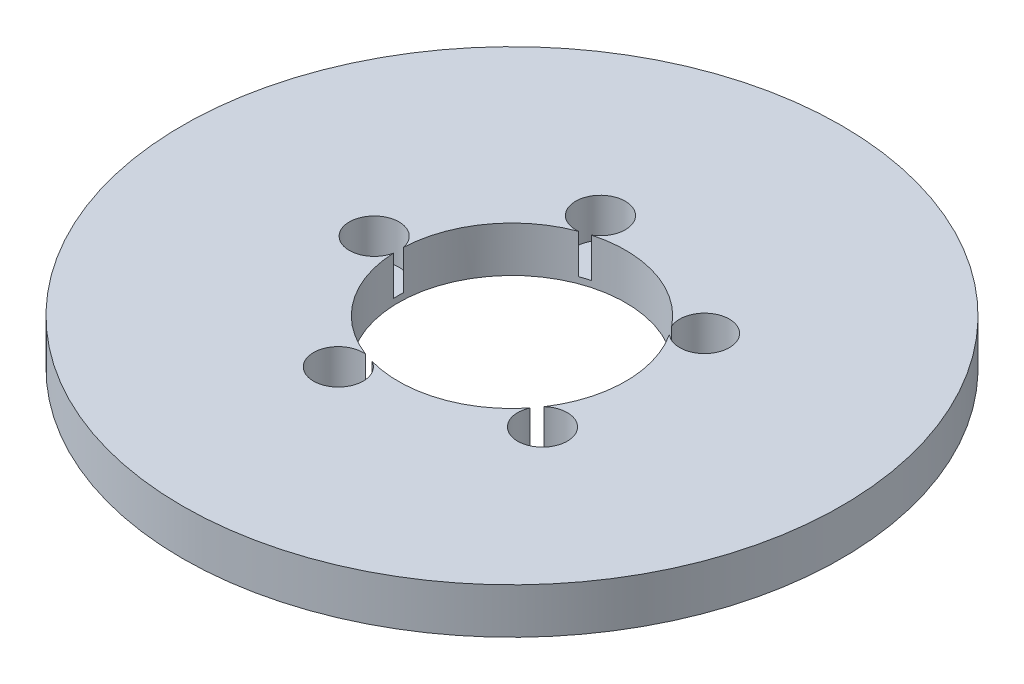
ISO-10303-21;
HEADER;
FILE_DESCRIPTION(('STEP AP214'),'2;1');
FILE_NAME('part.step','',(''),(''),'','','');
FILE_SCHEMA(('AUTOMOTIVE_DESIGN { 1 0 10303 214 1 1 1 1 }'));
ENDSEC;
DATA;
#1=APPLICATION_CONTEXT('core data for automotive mechanical design processes');
#2=APPLICATION_PROTOCOL_DEFINITION('international standard','automotive_design',2000,#1);
#3=PRODUCT_CONTEXT('',#1,'mechanical');
#4=PRODUCT('Part','Part','',(#3));
#5=PRODUCT_RELATED_PRODUCT_CATEGORY('part','',(#4));
#6=PRODUCT_DEFINITION_FORMATION('','',#4);
#7=PRODUCT_DEFINITION_CONTEXT('part definition',#1,'design');
#8=PRODUCT_DEFINITION('design','',#6,#7);
#9=PRODUCT_DEFINITION_SHAPE('','',#8);
#10=(LENGTH_UNIT() NAMED_UNIT(*) SI_UNIT(.MILLI.,.METRE.));
#11=(NAMED_UNIT(*) PLANE_ANGLE_UNIT() SI_UNIT($,.RADIAN.));
#12=(NAMED_UNIT(*) SI_UNIT($,.STERADIAN.) SOLID_ANGLE_UNIT());
#13=UNCERTAINTY_MEASURE_WITH_UNIT(LENGTH_MEASURE(1.E-05),#10,'distance_accuracy_value','');
#14=(GEOMETRIC_REPRESENTATION_CONTEXT(3) GLOBAL_UNCERTAINTY_ASSIGNED_CONTEXT((#13)) GLOBAL_UNIT_ASSIGNED_CONTEXT((#10,
#11,#12)) REPRESENTATION_CONTEXT('',''));
#15=CARTESIAN_POINT('',(0.,0.,0.));
#16=DIRECTION('',(0.,0.,1.));
#17=DIRECTION('',(1.,0.,0.));
#18=AXIS2_PLACEMENT_3D('',#15,#16,#17);
#19=CARTESIAN_POINT('',(0.,10.,0.));
#20=DIRECTION('',(0.,-1.,0.));
#21=DIRECTION('',(0.,0.,-1.));
#22=AXIS2_PLACEMENT_3D('',#19,#20,#21);
#23=CYLINDRICAL_SURFACE('',#22,72.5);
#24=CARTESIAN_POINT('',(0.,10.,0.));
#25=DIRECTION('',(0.,1.,0.));
#26=DIRECTION('',(0.,0.,1.));
#27=AXIS2_PLACEMENT_3D('',#24,#25,#26);
#28=CIRCLE('',#27,72.5);
#29=CARTESIAN_POINT('',(0.,10.,72.5));
#30=VERTEX_POINT('',#29);
#31=EDGE_CURVE('E160',#30,#30,#28,.T.);
#32=ORIENTED_EDGE('',*,*,#31,.F.);
#33=EDGE_LOOP('',(#32));
#34=FACE_BOUND('',#33,.T.);
#35=CARTESIAN_POINT('',(0.,0.,0.));
#36=DIRECTION('',(0.,1.,0.));
#37=DIRECTION('',(0.,0.,1.));
#38=AXIS2_PLACEMENT_3D('',#35,#36,#37);
#39=CIRCLE('',#38,72.5);
#40=CARTESIAN_POINT('',(0.,0.,72.5));
#41=VERTEX_POINT('',#40);
#42=EDGE_CURVE('E153',#41,#41,#39,.T.);
#43=ORIENTED_EDGE('',*,*,#42,.T.);
#44=EDGE_LOOP('',(#43));
#45=FACE_BOUND('',#44,.T.);
#46=ADVANCED_FACE('F39',(#34,#45),#23,.T.);
#47=CARTESIAN_POINT('',(0.,10.,0.));
#48=DIRECTION('',(0.,1.,0.));
#49=DIRECTION('',(0.,0.,1.));
#50=AXIS2_PLACEMENT_3D('',#47,#48,#49);
#51=PLANE('',#50);
#52=CARTESIAN_POINT('',(-9.36912817671135,10.,28.8352115471496));
#53=DIRECTION('',(0.,1.,0.));
#54=DIRECTION('',(0.951056516295155,0.,0.309016994374945));
#55=AXIS2_PLACEMENT_3D('',#52,#53,#54);
#56=CIRCLE('',#55,5.45902859178882);
#57=CARTESIAN_POINT('',(-8.77792244755192,10.,23.4082907856333));
#58=VERTEX_POINT('',#57);
#59=CARTESIAN_POINT('',(-6.65755966979406,10.,24.0972384152859));
#60=VERTEX_POINT('',#59);
#61=EDGE_CURVE('E186',#58,#60,#56,.T.);
#62=ORIENTED_EDGE('',*,*,#61,.F.);
#63=CARTESIAN_POINT('',(0.,10.,0.));
#64=DIRECTION('',(0.,1.,0.));
#65=DIRECTION('',(0.,0.,1.));
#66=AXIS2_PLACEMENT_3D('',#63,#64,#65);
#67=CIRCLE('',#66,25.);
#68=CARTESIAN_POINT('',(-24.9751346986072,10.,1.11474068124668));
#69=VERTEX_POINT('',#68);
#70=EDGE_CURVE('E148',#69,#58,#67,.T.);
#71=ORIENTED_EDGE('',*,*,#70,.F.);
#72=CARTESIAN_POINT('',(-30.3191356697469,10.,0.));
#73=DIRECTION('',(0.,1.,0.));
#74=DIRECTION('',(0.,0.,1.));
#75=AXIS2_PLACEMENT_3D('',#72,#73,#74);
#76=CIRCLE('',#75,5.45902859178882);
#77=CARTESIAN_POINT('',(-24.9751346986072,10.,-1.11474068124668));
#78=VERTEX_POINT('',#77);
#79=EDGE_CURVE('E142',#78,#69,#76,.T.);
#80=ORIENTED_EDGE('',*,*,#79,.F.);
#81=CARTESIAN_POINT('',(-8.77792244755228,10.,-23.4082907856332));
#82=VERTEX_POINT('',#81);
#83=EDGE_CURVE('E132',#82,#78,#67,.T.);
#84=ORIENTED_EDGE('',*,*,#83,.F.);
#85=CARTESIAN_POINT('',(-9.36912817671176,10.,-28.8352115471495));
#86=DIRECTION('',(0.,1.,0.));
#87=DIRECTION('',(-0.95105651629515,0.,0.309016994374958));
#88=AXIS2_PLACEMENT_3D('',#85,#86,#87);
#89=CIRCLE('',#88,5.45902859178882);
#90=CARTESIAN_POINT('',(-6.65755966979437,10.,-24.0972384152858));
#91=VERTEX_POINT('',#90);
#92=EDGE_CURVE('E111',#91,#82,#89,.T.);
#93=ORIENTED_EDGE('',*,*,#92,.F.);
#94=CARTESIAN_POINT('',(19.5500802754093,10.,-15.5818600053092));
#95=VERTEX_POINT('',#94);
#96=EDGE_CURVE('E141',#95,#91,#67,.T.);
#97=ORIENTED_EDGE('',*,*,#96,.F.);
#98=CARTESIAN_POINT('',(24.5286960115847,10.,-17.8211408089321));
#99=DIRECTION('',(0.,1.,0.));
#100=DIRECTION('',(-0.58778525229248,0.,-0.809016994374942));
#101=AXIS2_PLACEMENT_3D('',#98,#99,#100);
#102=CIRCLE('',#101,5.45902859178882);
#103=CARTESIAN_POINT('',(20.8605365405438,10.,-13.7781716944098));
#104=VERTEX_POINT('',#103);
#105=EDGE_CURVE('E173',#104,#95,#102,.T.);
#106=ORIENTED_EDGE('',*,*,#105,.F.);
#107=CARTESIAN_POINT('',(20.860536540544,10.,13.7781716944095));
#108=VERTEX_POINT('',#107);
#109=EDGE_CURVE('E150',#108,#104,#67,.T.);
#110=ORIENTED_EDGE('',*,*,#109,.F.);
#111=CARTESIAN_POINT('',(24.528696011585,10.,17.8211408089317));
#112=DIRECTION('',(0.,1.,0.));
#113=DIRECTION('',(0.587785252292469,0.,-0.809016994374951));
#114=AXIS2_PLACEMENT_3D('',#111,#112,#113);
#115=CIRCLE('',#114,5.45902859178882);
#116=CARTESIAN_POINT('',(19.5500802754095,10.,15.5818600053089));
#117=VERTEX_POINT('',#116);
#118=EDGE_CURVE('E172',#117,#108,#115,.T.);
#119=ORIENTED_EDGE('',*,*,#118,.F.);
#120=EDGE_CURVE('E152',#60,#117,#67,.T.);
#121=ORIENTED_EDGE('',*,*,#120,.F.);
#122=EDGE_LOOP('',(#62,#71,#80,#84,#93,#97,#106,#110,#119,#121));
#123=FACE_BOUND('',#122,.T.);
#124=ORIENTED_EDGE('',*,*,#31,.T.);
#125=EDGE_LOOP('',(#124));
#126=FACE_BOUND('',#125,.T.);
#127=ADVANCED_FACE('F138',(#123,#126),#51,.T.);
#128=CARTESIAN_POINT('',(0.,0.,0.));
#129=DIRECTION('',(0.,1.,0.));
#130=DIRECTION('',(0.,0.,1.));
#131=AXIS2_PLACEMENT_3D('',#128,#129,#130);
#132=PLANE('',#131);
#133=CARTESIAN_POINT('',(0.,0.,0.));
#134=DIRECTION('',(0.,1.,0.));
#135=DIRECTION('',(0.,0.,1.));
#136=AXIS2_PLACEMENT_3D('',#133,#134,#135);
#137=CIRCLE('',#136,25.);
#138=CARTESIAN_POINT('',(0.,0.,25.));
#139=VERTEX_POINT('',#138);
#140=EDGE_CURVE('E145',#139,#139,#137,.T.);
#141=ORIENTED_EDGE('',*,*,#140,.T.);
#142=EDGE_LOOP('',(#141));
#143=FACE_BOUND('',#142,.T.);
#144=ORIENTED_EDGE('',*,*,#42,.F.);
#145=EDGE_LOOP('',(#144));
#146=FACE_BOUND('',#145,.T.);
#147=ADVANCED_FACE('F216',(#143,#146),#132,.F.);
#148=CARTESIAN_POINT('',(0.,10.,0.));
#149=DIRECTION('',(0.,-1.,0.));
#150=DIRECTION('',(0.,0.,-1.));
#151=AXIS2_PLACEMENT_3D('',#148,#149,#150);
#152=CYLINDRICAL_SURFACE('',#151,25.);
#153=DIRECTION('',(0.,1.,0.));
#154=VECTOR('',#153,1.);
#155=CARTESIAN_POINT('',(-8.77792244755195,5.67729908317657,23.4082907856333));
#156=LINE('',#155,#154);
#157=CARTESIAN_POINT('',(-8.77792244755192,1.35459816635315,23.4082907856333));
#158=VERTEX_POINT('',#157);
#159=EDGE_CURVE('E11',#158,#58,#156,.T.);
#160=ORIENTED_EDGE('',*,*,#159,.F.);
#161=CARTESIAN_POINT('',(0.,1.35459816635315,0.));
#162=DIRECTION('',(0.,1.,0.));
#163=DIRECTION('',(0.,0.,1.));
#164=AXIS2_PLACEMENT_3D('',#161,#162,#163);
#165=CIRCLE('',#164,25.);
#166=CARTESIAN_POINT('',(-6.65755966979406,1.35459816635315,24.0972384152859));
#167=VERTEX_POINT('',#166);
#168=EDGE_CURVE('E192',#158,#167,#165,.T.);
#169=ORIENTED_EDGE('',*,*,#168,.T.);
#170=DIRECTION('',(0.,1.,0.));
#171=VECTOR('',#170,1.);
#172=CARTESIAN_POINT('',(-6.65755966979403,5.67729908317657,24.0972384152859));
#173=LINE('',#172,#171);
#174=EDGE_CURVE('E46',#60,#167,#173,.F.);
#175=ORIENTED_EDGE('',*,*,#174,.F.);
#176=ORIENTED_EDGE('',*,*,#120,.T.);
#177=DIRECTION('',(0.,1.,0.));
#178=VECTOR('',#177,1.);
#179=CARTESIAN_POINT('',(19.5500802754095,5.67729908317657,15.5818600053089));
#180=LINE('',#179,#178);
#181=CARTESIAN_POINT('',(19.5500802754095,1.35459816635315,15.5818600053089));
#182=VERTEX_POINT('',#181);
#183=EDGE_CURVE('E195',#182,#117,#180,.T.);
#184=ORIENTED_EDGE('',*,*,#183,.F.);
#185=CARTESIAN_POINT('',(0.,1.35459816635315,0.));
#186=DIRECTION('',(0.,1.,0.));
#187=DIRECTION('',(0.,0.,1.));
#188=AXIS2_PLACEMENT_3D('',#185,#186,#187);
#189=CIRCLE('',#188,25.);
#190=CARTESIAN_POINT('',(20.860536540544,1.35459816635315,13.7781716944095));
#191=VERTEX_POINT('',#190);
#192=EDGE_CURVE('E197',#182,#191,#189,.T.);
#193=ORIENTED_EDGE('',*,*,#192,.T.);
#194=DIRECTION('',(0.,1.,0.));
#195=VECTOR('',#194,1.);
#196=CARTESIAN_POINT('',(20.860536540544,5.67729908317657,13.7781716944095));
#197=LINE('',#196,#195);
#198=EDGE_CURVE('E168',#108,#191,#197,.F.);
#199=ORIENTED_EDGE('',*,*,#198,.F.);
#200=ORIENTED_EDGE('',*,*,#109,.T.);
#201=DIRECTION('',(0.,1.,0.));
#202=VECTOR('',#201,1.);
#203=CARTESIAN_POINT('',(20.8605365405438,5.67729908317657,-13.7781716944098));
#204=LINE('',#203,#202);
#205=CARTESIAN_POINT('',(20.8605365405438,1.35459816635315,-13.7781716944098));
#206=VERTEX_POINT('',#205);
#207=EDGE_CURVE('E169',#206,#104,#204,.T.);
#208=ORIENTED_EDGE('',*,*,#207,.F.);
#209=CARTESIAN_POINT('',(0.,1.35459816635315,0.));
#210=DIRECTION('',(0.,1.,0.));
#211=DIRECTION('',(0.,0.,1.));
#212=AXIS2_PLACEMENT_3D('',#209,#210,#211);
#213=CIRCLE('',#212,25.);
#214=CARTESIAN_POINT('',(19.5500802754093,1.35459816635315,-15.5818600053092));
#215=VERTEX_POINT('',#214);
#216=EDGE_CURVE('E332',#206,#215,#213,.T.);
#217=ORIENTED_EDGE('',*,*,#216,.T.);
#218=DIRECTION('',(0.,1.,0.));
#219=VECTOR('',#218,1.);
#220=CARTESIAN_POINT('',(19.5500802754093,5.67729908317657,-15.5818600053092));
#221=LINE('',#220,#219);
#222=EDGE_CURVE('E335',#95,#215,#221,.F.);
#223=ORIENTED_EDGE('',*,*,#222,.F.);
#224=ORIENTED_EDGE('',*,*,#96,.T.);
#225=DIRECTION('',(0.,1.,0.));
#226=VECTOR('',#225,1.);
#227=CARTESIAN_POINT('',(-6.65755966979437,5.67729908317657,-24.0972384152858));
#228=LINE('',#227,#226);
#229=CARTESIAN_POINT('',(-6.65755966979437,1.35459816635315,-24.0972384152858));
#230=VERTEX_POINT('',#229);
#231=EDGE_CURVE('E121',#230,#91,#228,.T.);
#232=ORIENTED_EDGE('',*,*,#231,.F.);
#233=CARTESIAN_POINT('',(0.,1.35459816635315,0.));
#234=DIRECTION('',(0.,1.,0.));
#235=DIRECTION('',(0.,0.,1.));
#236=AXIS2_PLACEMENT_3D('',#233,#234,#235);
#237=CIRCLE('',#236,25.);
#238=CARTESIAN_POINT('',(-8.77792244755228,1.35459816635315,-23.4082907856332));
#239=VERTEX_POINT('',#238);
#240=EDGE_CURVE('E134',#230,#239,#237,.T.);
#241=ORIENTED_EDGE('',*,*,#240,.T.);
#242=DIRECTION('',(0.,1.,0.));
#243=VECTOR('',#242,1.);
#244=CARTESIAN_POINT('',(-8.77792244755228,5.67729908317657,-23.4082907856332));
#245=LINE('',#244,#243);
#246=EDGE_CURVE('E117',#82,#239,#245,.F.);
#247=ORIENTED_EDGE('',*,*,#246,.F.);
#248=ORIENTED_EDGE('',*,*,#83,.T.);
#249=DIRECTION('',(0.,1.,0.));
#250=VECTOR('',#249,1.);
#251=CARTESIAN_POINT('',(-24.9751346986072,5.67729908317657,-1.11474068124669));
#252=LINE('',#251,#250);
#253=CARTESIAN_POINT('',(-24.9751346986072,1.35459816635315,-1.11474068124668));
#254=VERTEX_POINT('',#253);
#255=EDGE_CURVE('E338',#254,#78,#252,.T.);
#256=ORIENTED_EDGE('',*,*,#255,.F.);
#257=CARTESIAN_POINT('',(0.,1.35459816635315,0.));
#258=DIRECTION('',(0.,1.,0.));
#259=DIRECTION('',(0.,0.,1.));
#260=AXIS2_PLACEMENT_3D('',#257,#258,#259);
#261=CIRCLE('',#260,25.);
#262=CARTESIAN_POINT('',(-24.9751346986072,1.35459816635315,1.11474068124668));
#263=VERTEX_POINT('',#262);
#264=EDGE_CURVE('E342',#254,#263,#261,.T.);
#265=ORIENTED_EDGE('',*,*,#264,.T.);
#266=DIRECTION('',(0.,1.,0.));
#267=VECTOR('',#266,1.);
#268=CARTESIAN_POINT('',(-24.9751346986072,5.67729908317657,1.11474068124669));
#269=LINE('',#268,#267);
#270=EDGE_CURVE('E341',#69,#263,#269,.F.);
#271=ORIENTED_EDGE('',*,*,#270,.F.);
#272=ORIENTED_EDGE('',*,*,#70,.T.);
#273=EDGE_LOOP('',(#160,#169,#175,#176,#184,#193,#199,#200,#208,#217,#223,#224,#232,#241,#247,
#248,#256,#265,#271,#272));
#274=FACE_BOUND('',#273,.T.);
#275=ORIENTED_EDGE('',*,*,#140,.F.);
#276=EDGE_LOOP('',(#275));
#277=FACE_BOUND('',#276,.T.);
#278=ADVANCED_FACE('F128',(#274,#277),#152,.F.);
#279=CARTESIAN_POINT('',(-30.3191356697469,1.35459816635315,0.));
#280=DIRECTION('',(0.,1.,0.));
#281=DIRECTION('',(0.,0.,1.));
#282=AXIS2_PLACEMENT_3D('',#279,#280,#281);
#283=CYLINDRICAL_SURFACE('',#282,5.45902859178882);
#284=ORIENTED_EDGE('',*,*,#255,.T.);
#285=ORIENTED_EDGE('',*,*,#79,.T.);
#286=ORIENTED_EDGE('',*,*,#270,.T.);
#287=CARTESIAN_POINT('',(-30.3191356697469,1.35459816635315,0.));
#288=DIRECTION('',(0.,1.,0.));
#289=DIRECTION('',(0.,0.,1.));
#290=AXIS2_PLACEMENT_3D('',#287,#288,#289);
#291=CIRCLE('',#290,5.45902859178882);
#292=EDGE_CURVE('E149',#254,#263,#291,.T.);
#293=ORIENTED_EDGE('',*,*,#292,.F.);
#294=EDGE_LOOP('',(#284,#285,#286,#293));
#295=FACE_BOUND('',#294,.T.);
#296=ADVANCED_FACE('F227',(#295),#283,.F.);
#297=CARTESIAN_POINT('',(-30.3191356697469,1.35459816635315,0.));
#298=DIRECTION('',(0.,1.,0.));
#299=DIRECTION('',(0.,0.,1.));
#300=AXIS2_PLACEMENT_3D('',#297,#298,#299);
#301=PLANE('',#300);
#302=ORIENTED_EDGE('',*,*,#292,.T.);
#303=ORIENTED_EDGE('',*,*,#264,.F.);
#304=EDGE_LOOP('',(#302,#303));
#305=FACE_BOUND('',#304,.T.);
#306=ADVANCED_FACE('F235',(#305),#301,.T.);
#307=CARTESIAN_POINT('',(-9.36912817671176,1.35459816635315,-28.8352115471495));
#308=DIRECTION('',(0.,1.,0.));
#309=DIRECTION('',(0.,0.,1.));
#310=AXIS2_PLACEMENT_3D('',#307,#308,#309);
#311=CYLINDRICAL_SURFACE('',#310,5.45902859178882);
#312=ORIENTED_EDGE('',*,*,#231,.T.);
#313=ORIENTED_EDGE('',*,*,#92,.T.);
#314=ORIENTED_EDGE('',*,*,#246,.T.);
#315=CARTESIAN_POINT('',(-9.36912817671176,1.35459816635315,-28.8352115471495));
#316=DIRECTION('',(0.,1.,0.));
#317=DIRECTION('',(-0.95105651629515,0.,0.309016994374958));
#318=AXIS2_PLACEMENT_3D('',#315,#316,#317);
#319=CIRCLE('',#318,5.45902859178882);
#320=EDGE_CURVE('E127',#230,#239,#319,.T.);
#321=ORIENTED_EDGE('',*,*,#320,.F.);
#322=EDGE_LOOP('',(#312,#313,#314,#321));
#323=FACE_BOUND('',#322,.T.);
#324=ADVANCED_FACE('F116',(#323),#311,.F.);
#325=CARTESIAN_POINT('',(-9.36912817671176,1.35459816635315,-28.8352115471495));
#326=DIRECTION('',(0.,1.,0.));
#327=DIRECTION('',(-0.95105651629515,0.,0.309016994374958));
#328=AXIS2_PLACEMENT_3D('',#325,#326,#327);
#329=PLANE('',#328);
#330=ORIENTED_EDGE('',*,*,#320,.T.);
#331=ORIENTED_EDGE('',*,*,#240,.F.);
#332=EDGE_LOOP('',(#330,#331));
#333=FACE_BOUND('',#332,.T.);
#334=ADVANCED_FACE('F236',(#333),#329,.T.);
#335=CARTESIAN_POINT('',(24.5286960115847,1.35459816635315,-17.8211408089321));
#336=DIRECTION('',(0.,1.,0.));
#337=DIRECTION('',(0.,0.,1.));
#338=AXIS2_PLACEMENT_3D('',#335,#336,#337);
#339=CYLINDRICAL_SURFACE('',#338,5.45902859178882);
#340=ORIENTED_EDGE('',*,*,#207,.T.);
#341=ORIENTED_EDGE('',*,*,#105,.T.);
#342=ORIENTED_EDGE('',*,*,#222,.T.);
#343=CARTESIAN_POINT('',(24.5286960115847,1.35459816635315,-17.8211408089321));
#344=DIRECTION('',(0.,1.,0.));
#345=DIRECTION('',(-0.58778525229248,0.,-0.809016994374942));
#346=AXIS2_PLACEMENT_3D('',#343,#344,#345);
#347=CIRCLE('',#346,5.45902859178882);
#348=EDGE_CURVE('E177',#206,#215,#347,.T.);
#349=ORIENTED_EDGE('',*,*,#348,.F.);
#350=EDGE_LOOP('',(#340,#341,#342,#349));
#351=FACE_BOUND('',#350,.T.);
#352=ADVANCED_FACE('F241',(#351),#339,.F.);
#353=CARTESIAN_POINT('',(24.5286960115847,1.35459816635315,-17.8211408089321));
#354=DIRECTION('',(0.,1.,0.));
#355=DIRECTION('',(-0.58778525229248,0.,-0.809016994374942));
#356=AXIS2_PLACEMENT_3D('',#353,#354,#355);
#357=PLANE('',#356);
#358=ORIENTED_EDGE('',*,*,#348,.T.);
#359=ORIENTED_EDGE('',*,*,#216,.F.);
#360=EDGE_LOOP('',(#358,#359));
#361=FACE_BOUND('',#360,.T.);
#362=ADVANCED_FACE('F244',(#361),#357,.T.);
#363=CARTESIAN_POINT('',(24.528696011585,1.35459816635315,17.8211408089317));
#364=DIRECTION('',(0.,1.,0.));
#365=DIRECTION('',(0.,0.,1.));
#366=AXIS2_PLACEMENT_3D('',#363,#364,#365);
#367=CYLINDRICAL_SURFACE('',#366,5.45902859178882);
#368=ORIENTED_EDGE('',*,*,#183,.T.);
#369=ORIENTED_EDGE('',*,*,#118,.T.);
#370=ORIENTED_EDGE('',*,*,#198,.T.);
#371=CARTESIAN_POINT('',(24.528696011585,1.35459816635315,17.8211408089317));
#372=DIRECTION('',(0.,1.,0.));
#373=DIRECTION('',(0.587785252292469,0.,-0.809016994374951));
#374=AXIS2_PLACEMENT_3D('',#371,#372,#373);
#375=CIRCLE('',#374,5.45902859178882);
#376=EDGE_CURVE('E56',#182,#191,#375,.T.);
#377=ORIENTED_EDGE('',*,*,#376,.F.);
#378=EDGE_LOOP('',(#368,#369,#370,#377));
#379=FACE_BOUND('',#378,.T.);
#380=ADVANCED_FACE('F191',(#379),#367,.F.);
#381=CARTESIAN_POINT('',(24.528696011585,1.35459816635315,17.8211408089317));
#382=DIRECTION('',(0.,1.,0.));
#383=DIRECTION('',(0.587785252292469,0.,-0.809016994374951));
#384=AXIS2_PLACEMENT_3D('',#381,#382,#383);
#385=PLANE('',#384);
#386=ORIENTED_EDGE('',*,*,#376,.T.);
#387=ORIENTED_EDGE('',*,*,#192,.F.);
#388=EDGE_LOOP('',(#386,#387));
#389=FACE_BOUND('',#388,.T.);
#390=ADVANCED_FACE('F208',(#389),#385,.T.);
#391=CARTESIAN_POINT('',(-9.36912817671135,1.35459816635315,28.8352115471496));
#392=DIRECTION('',(0.,1.,0.));
#393=DIRECTION('',(0.,0.,1.));
#394=AXIS2_PLACEMENT_3D('',#391,#392,#393);
#395=CYLINDRICAL_SURFACE('',#394,5.45902859178882);
#396=ORIENTED_EDGE('',*,*,#159,.T.);
#397=ORIENTED_EDGE('',*,*,#61,.T.);
#398=ORIENTED_EDGE('',*,*,#174,.T.);
#399=CARTESIAN_POINT('',(-9.36912817671135,1.35459816635315,28.8352115471496));
#400=DIRECTION('',(0.,1.,0.));
#401=DIRECTION('',(0.951056516295155,0.,0.309016994374945));
#402=AXIS2_PLACEMENT_3D('',#399,#400,#401);
#403=CIRCLE('',#402,5.45902859178882);
#404=EDGE_CURVE('E55',#158,#167,#403,.T.);
#405=ORIENTED_EDGE('',*,*,#404,.F.);
#406=EDGE_LOOP('',(#396,#397,#398,#405));
#407=FACE_BOUND('',#406,.T.);
#408=ADVANCED_FACE('F203',(#407),#395,.F.);
#409=CARTESIAN_POINT('',(-9.36912817671135,1.35459816635315,28.8352115471496));
#410=DIRECTION('',(0.,1.,0.));
#411=DIRECTION('',(0.951056516295155,0.,0.309016994374945));
#412=AXIS2_PLACEMENT_3D('',#409,#410,#411);
#413=PLANE('',#412);
#414=ORIENTED_EDGE('',*,*,#404,.T.);
#415=ORIENTED_EDGE('',*,*,#168,.F.);
#416=EDGE_LOOP('',(#414,#415));
#417=FACE_BOUND('',#416,.T.);
#418=ADVANCED_FACE('F205',(#417),#413,.T.);
#419=CLOSED_SHELL('',(#46,#127,#147,#278,#296,#306,#324,#334,#352,#362,#380,#390,#408,#418));
#420=MANIFOLD_SOLID_BREP('B2',#419);
#421=ADVANCED_BREP_SHAPE_REPRESENTATION('',(#18,#420),#14);
#422=SHAPE_DEFINITION_REPRESENTATION(#9,#421);
ENDSEC;
END-ISO-10303-21;
